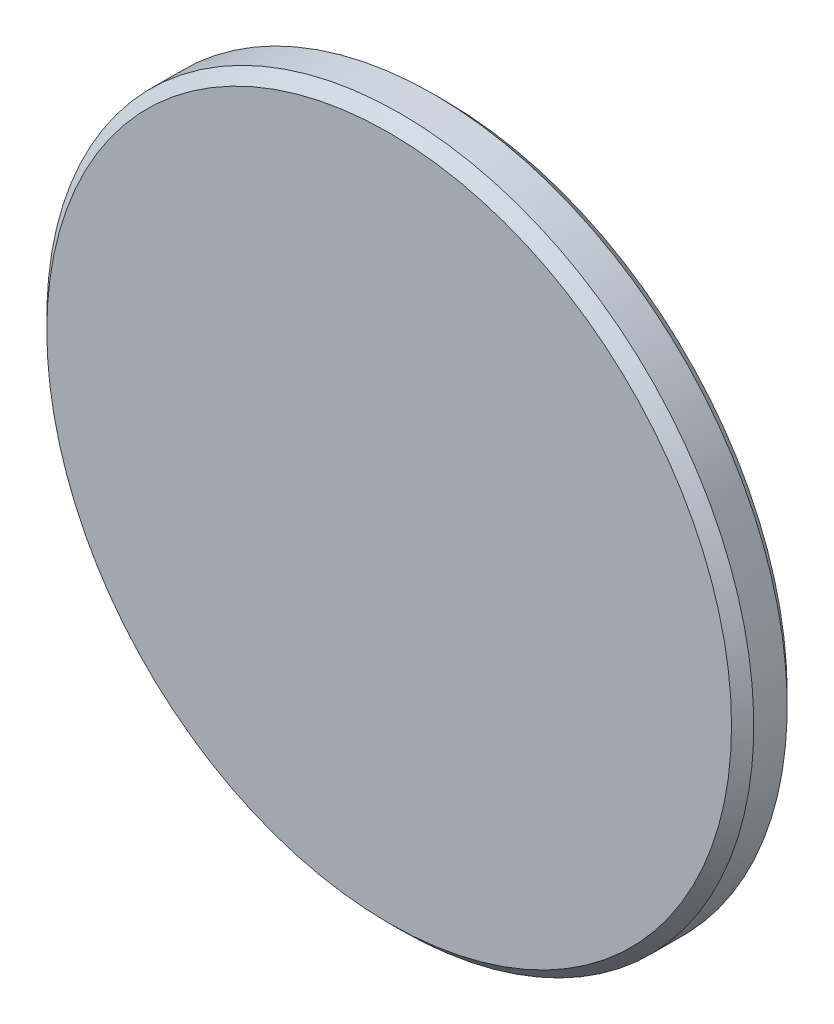
ISO-10303-21;
HEADER;
FILE_DESCRIPTION(('STEP AP214'),'2;1');
FILE_NAME('part.step','',(''),(''),'','','');
FILE_SCHEMA(('AUTOMOTIVE_DESIGN { 1 0 10303 214 1 1 1 1 }'));
ENDSEC;
DATA;
#1=APPLICATION_CONTEXT('core data for automotive mechanical design processes');
#2=APPLICATION_PROTOCOL_DEFINITION('international standard','automotive_design',2000,#1);
#3=PRODUCT_CONTEXT('',#1,'mechanical');
#4=PRODUCT('Part','Part','',(#3));
#5=PRODUCT_RELATED_PRODUCT_CATEGORY('part','',(#4));
#6=PRODUCT_DEFINITION_FORMATION('','',#4);
#7=PRODUCT_DEFINITION_CONTEXT('part definition',#1,'design');
#8=PRODUCT_DEFINITION('design','',#6,#7);
#9=PRODUCT_DEFINITION_SHAPE('','',#8);
#10=(LENGTH_UNIT() NAMED_UNIT(*) SI_UNIT(.MILLI.,.METRE.));
#11=(NAMED_UNIT(*) PLANE_ANGLE_UNIT() SI_UNIT($,.RADIAN.));
#12=(NAMED_UNIT(*) SI_UNIT($,.STERADIAN.) SOLID_ANGLE_UNIT());
#13=UNCERTAINTY_MEASURE_WITH_UNIT(LENGTH_MEASURE(1.E-05),#10,'distance_accuracy_value','');
#14=(GEOMETRIC_REPRESENTATION_CONTEXT(3) GLOBAL_UNCERTAINTY_ASSIGNED_CONTEXT((#13)) GLOBAL_UNIT_ASSIGNED_CONTEXT((#10,
#11,#12)) REPRESENTATION_CONTEXT('',''));
#15=CARTESIAN_POINT('',(0.,0.,0.));
#16=DIRECTION('',(0.,0.,1.));
#17=DIRECTION('',(1.,0.,0.));
#18=AXIS2_PLACEMENT_3D('',#15,#16,#17);
#19=CARTESIAN_POINT('',(0.,-6.35,-0.500000000000001));
#20=DIRECTION('',(0.,0.,1.));
#21=DIRECTION('',(0.,-1.,0.));
#22=AXIS2_PLACEMENT_3D('',#19,#20,#21);
#23=PLANE('',#22);
#24=CARTESIAN_POINT('',(0.,0.,-0.499999999999999));
#25=DIRECTION('',(0.,0.,1.));
#26=DIRECTION('',(0.,-1.,0.));
#27=AXIS2_PLACEMENT_3D('',#24,#25,#26);
#28=CIRCLE('',#27,6.15);
#29=CARTESIAN_POINT('',(0.,-6.15,-0.5));
#30=VERTEX_POINT('',#29);
#31=EDGE_CURVE('E24',#30,#30,#28,.F.);
#32=ORIENTED_EDGE('',*,*,#31,.T.);
#33=EDGE_LOOP('',(#32));
#34=FACE_BOUND('',#33,.T.);
#35=CARTESIAN_POINT('',(0.,0.,-0.499999999999999));
#36=DIRECTION('',(0.,0.,1.));
#37=DIRECTION('',(0.,-1.,0.));
#38=AXIS2_PLACEMENT_3D('',#35,#36,#37);
#39=CIRCLE('',#38,5.715);
#40=CARTESIAN_POINT('',(0.,-5.715,-0.5));
#41=VERTEX_POINT('',#40);
#42=EDGE_CURVE('E9',#41,#41,#39,.F.);
#43=ORIENTED_EDGE('',*,*,#42,.F.);
#44=EDGE_LOOP('',(#43));
#45=FACE_BOUND('',#44,.T.);
#46=ADVANCED_FACE('F13',(#34,#45),#23,.F.);
#47=CARTESIAN_POINT('',(0.,0.,0.499999999999999));
#48=DIRECTION('',(0.,0.,-1.));
#49=DIRECTION('',(0.,1.,0.));
#50=AXIS2_PLACEMENT_3D('',#47,#48,#49);
#51=PLANE('',#50);
#52=CARTESIAN_POINT('',(0.,0.,0.499999999999999));
#53=DIRECTION('',(0.,0.,-1.));
#54=DIRECTION('',(0.,1.,0.));
#55=AXIS2_PLACEMENT_3D('',#52,#53,#54);
#56=CIRCLE('',#55,6.15);
#57=CARTESIAN_POINT('',(0.,6.15,0.5));
#58=VERTEX_POINT('',#57);
#59=EDGE_CURVE('E20',#58,#58,#56,.F.);
#60=ORIENTED_EDGE('',*,*,#59,.T.);
#61=EDGE_LOOP('',(#60));
#62=FACE_BOUND('',#61,.T.);
#63=ADVANCED_FACE('F57',(#62),#51,.F.);
#64=CARTESIAN_POINT('',(0.,0.,0.5));
#65=DIRECTION('',(0.,0.,1.));
#66=DIRECTION('',(0.,-1.,0.));
#67=AXIS2_PLACEMENT_3D('',#64,#65,#66);
#68=CYLINDRICAL_SURFACE('',#67,6.35);
#69=CARTESIAN_POINT('',(0.,0.,-0.300000000000003));
#70=DIRECTION('',(0.,0.,1.));
#71=DIRECTION('',(0.,-1.,0.));
#72=AXIS2_PLACEMENT_3D('',#69,#70,#71);
#73=CIRCLE('',#72,6.35);
#74=CARTESIAN_POINT('',(0.,-6.35,-0.300000000000004));
#75=VERTEX_POINT('',#74);
#76=EDGE_CURVE('E28',#75,#75,#73,.T.);
#77=ORIENTED_EDGE('',*,*,#76,.T.);
#78=EDGE_LOOP('',(#77));
#79=FACE_BOUND('',#78,.T.);
#80=CARTESIAN_POINT('',(0.,0.,0.3));
#81=DIRECTION('',(0.,0.,-1.));
#82=DIRECTION('',(0.,1.,0.));
#83=AXIS2_PLACEMENT_3D('',#80,#81,#82);
#84=CIRCLE('',#83,6.35);
#85=CARTESIAN_POINT('',(0.,6.35,0.300000000000001));
#86=VERTEX_POINT('',#85);
#87=EDGE_CURVE('E33',#86,#86,#84,.T.);
#88=ORIENTED_EDGE('',*,*,#87,.T.);
#89=EDGE_LOOP('',(#88));
#90=FACE_BOUND('',#89,.T.);
#91=ADVANCED_FACE('F63',(#79,#90),#68,.T.);
#92=CARTESIAN_POINT('',(0.,0.,-0.300000000000003));
#93=DIRECTION('',(0.,0.,1.));
#94=DIRECTION('',(0.,-1.,0.));
#95=AXIS2_PLACEMENT_3D('',#92,#93,#94);
#96=CONICAL_SURFACE('',#95,6.35,0.78539816339745);
#97=ORIENTED_EDGE('',*,*,#31,.F.);
#98=EDGE_LOOP('',(#97));
#99=FACE_BOUND('',#98,.T.);
#100=ORIENTED_EDGE('',*,*,#76,.F.);
#101=EDGE_LOOP('',(#100));
#102=FACE_BOUND('',#101,.T.);
#103=ADVANCED_FACE('F53',(#99,#102),#96,.T.);
#104=CARTESIAN_POINT('',(0.,0.,0.499999999999999));
#105=DIRECTION('',(0.,0.,-1.));
#106=DIRECTION('',(0.,1.,0.));
#107=AXIS2_PLACEMENT_3D('',#104,#105,#106);
#108=CONICAL_SURFACE('',#107,6.15,0.785398163397448);
#109=ORIENTED_EDGE('',*,*,#87,.F.);
#110=EDGE_LOOP('',(#109));
#111=FACE_BOUND('',#110,.T.);
#112=ORIENTED_EDGE('',*,*,#59,.F.);
#113=EDGE_LOOP('',(#112));
#114=FACE_BOUND('',#113,.T.);
#115=ADVANCED_FACE('F15',(#111,#114),#108,.T.);
#116=CARTESIAN_POINT('',(0.,0.,-0.509999999999999));
#117=DIRECTION('',(0.,0.,1.));
#118=DIRECTION('',(0.,-1.,0.));
#119=AXIS2_PLACEMENT_3D('',#116,#117,#118);
#120=CYLINDRICAL_SURFACE('',#119,5.715);
#121=CARTESIAN_POINT('',(0.,0.,-0.509999999999999));
#122=DIRECTION('',(0.,0.,-1.));
#123=DIRECTION('',(0.,1.,0.));
#124=AXIS2_PLACEMENT_3D('',#121,#122,#123);
#125=CIRCLE('',#124,5.715);
#126=CARTESIAN_POINT('',(0.,5.715,-0.509999999999998));
#127=VERTEX_POINT('',#126);
#128=EDGE_CURVE('E36',#127,#127,#125,.T.);
#129=ORIENTED_EDGE('',*,*,#128,.F.);
#130=EDGE_LOOP('',(#129));
#131=FACE_BOUND('',#130,.T.);
#132=ORIENTED_EDGE('',*,*,#42,.T.);
#133=EDGE_LOOP('',(#132));
#134=FACE_BOUND('',#133,.T.);
#135=ADVANCED_FACE('F42',(#131,#134),#120,.T.);
#136=CARTESIAN_POINT('',(0.,0.,-0.509999999999999));
#137=DIRECTION('',(0.,0.,-1.));
#138=DIRECTION('',(0.,1.,0.));
#139=AXIS2_PLACEMENT_3D('',#136,#137,#138);
#140=PLANE('',#139);
#141=ORIENTED_EDGE('',*,*,#128,.T.);
#142=EDGE_LOOP('',(#141));
#143=FACE_BOUND('',#142,.T.);
#144=ADVANCED_FACE('F40',(#143),#140,.T.);
#145=CLOSED_SHELL('',(#46,#63,#91,#103,#115,#135,#144));
#146=MANIFOLD_SOLID_BREP('B1',#145);
#147=ADVANCED_BREP_SHAPE_REPRESENTATION('',(#18,#146),#14);
#148=SHAPE_DEFINITION_REPRESENTATION(#9,#147);
ENDSEC;
END-ISO-10303-21;
